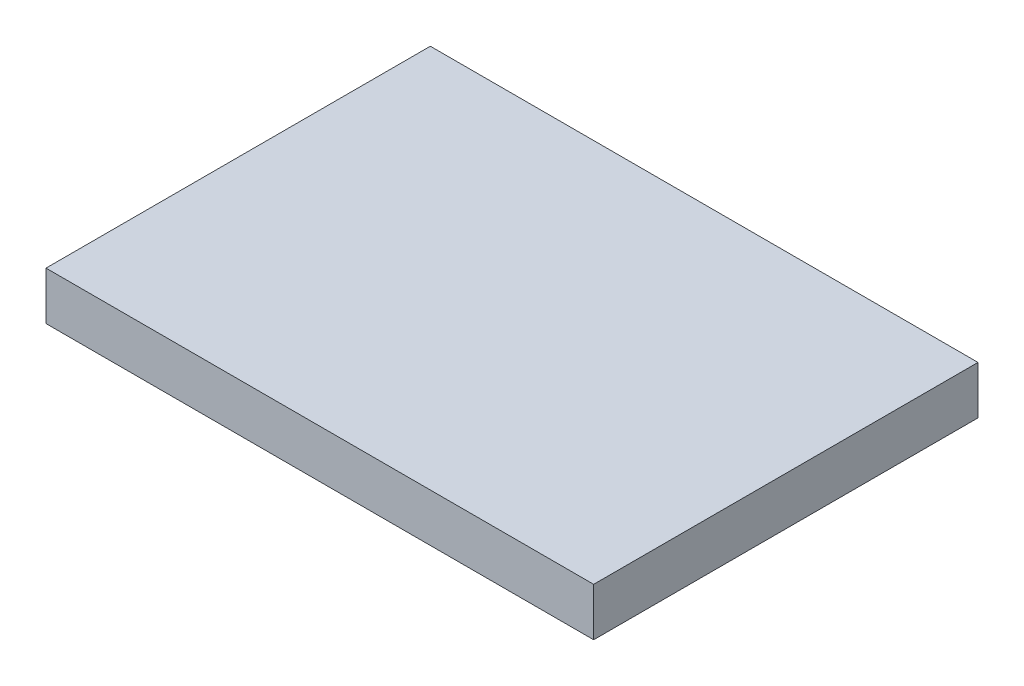
ISO-10303-21;
HEADER;
FILE_DESCRIPTION(('STEP AP214'),'2;1');
FILE_NAME('part.step','',(''),(''),'','','');
FILE_SCHEMA(('AUTOMOTIVE_DESIGN { 1 0 10303 214 1 1 1 1 }'));
ENDSEC;
DATA;
#1=APPLICATION_CONTEXT('core data for automotive mechanical design processes');
#2=APPLICATION_PROTOCOL_DEFINITION('international standard','automotive_design',2000,#1);
#3=PRODUCT_CONTEXT('',#1,'mechanical');
#4=PRODUCT('Part','Part','',(#3));
#5=PRODUCT_RELATED_PRODUCT_CATEGORY('part','',(#4));
#6=PRODUCT_DEFINITION_FORMATION('','',#4);
#7=PRODUCT_DEFINITION_CONTEXT('part definition',#1,'design');
#8=PRODUCT_DEFINITION('design','',#6,#7);
#9=PRODUCT_DEFINITION_SHAPE('','',#8);
#10=(LENGTH_UNIT() NAMED_UNIT(*) SI_UNIT(.MILLI.,.METRE.));
#11=(NAMED_UNIT(*) PLANE_ANGLE_UNIT() SI_UNIT($,.RADIAN.));
#12=(NAMED_UNIT(*) SI_UNIT($,.STERADIAN.) SOLID_ANGLE_UNIT());
#13=UNCERTAINTY_MEASURE_WITH_UNIT(LENGTH_MEASURE(1.E-05),#10,'distance_accuracy_value','');
#14=(GEOMETRIC_REPRESENTATION_CONTEXT(3) GLOBAL_UNCERTAINTY_ASSIGNED_CONTEXT((#13)) GLOBAL_UNIT_ASSIGNED_CONTEXT((#10,
#11,#12)) REPRESENTATION_CONTEXT('',''));
#15=CARTESIAN_POINT('',(0.,0.,0.));
#16=DIRECTION('',(0.,0.,1.));
#17=DIRECTION('',(1.,0.,0.));
#18=AXIS2_PLACEMENT_3D('',#15,#16,#17);
#19=CARTESIAN_POINT('',(-40.8625954198473,5.,-12.4885496183206));
#20=DIRECTION('',(1.,0.,0.));
#21=DIRECTION('',(0.,0.,-1.));
#22=AXIS2_PLACEMENT_3D('',#19,#20,#21);
#23=PLANE('',#22);
#24=DIRECTION('',(0.,0.,1.));
#25=VECTOR('',#24,1.);
#26=CARTESIAN_POINT('',(-40.8625954198473,0.,-12.4885496183206));
#27=LINE('',#26,#25);
#28=CARTESIAN_POINT('',(-40.8625954198473,0.,-12.4885496183206));
#29=VERTEX_POINT('',#28);
#30=CARTESIAN_POINT('',(-40.8625954198473,0.,27.5114503816794));
#31=VERTEX_POINT('',#30);
#32=EDGE_CURVE('E96',#29,#31,#27,.T.);
#33=ORIENTED_EDGE('',*,*,#32,.T.);
#34=DIRECTION('',(0.,-1.,0.));
#35=VECTOR('',#34,1.);
#36=CARTESIAN_POINT('',(-40.8625954198473,5.,27.5114503816794));
#37=LINE('',#36,#35);
#38=CARTESIAN_POINT('',(-40.8625954198473,5.,27.5114503816794));
#39=VERTEX_POINT('',#38);
#40=EDGE_CURVE('E11',#39,#31,#37,.T.);
#41=ORIENTED_EDGE('',*,*,#40,.F.);
#42=DIRECTION('',(0.,0.,1.));
#43=VECTOR('',#42,1.);
#44=CARTESIAN_POINT('',(-40.8625954198473,5.,-12.4885496183206));
#45=LINE('',#44,#43);
#46=CARTESIAN_POINT('',(-40.8625954198473,5.,-12.4885496183206));
#47=VERTEX_POINT('',#46);
#48=EDGE_CURVE('E84',#47,#39,#45,.T.);
#49=ORIENTED_EDGE('',*,*,#48,.F.);
#50=DIRECTION('',(0.,-1.,0.));
#51=VECTOR('',#50,1.);
#52=CARTESIAN_POINT('',(-40.8625954198473,5.,-12.4885496183206));
#53=LINE('',#52,#51);
#54=EDGE_CURVE('E92',#47,#29,#53,.T.);
#55=ORIENTED_EDGE('',*,*,#54,.T.);
#56=EDGE_LOOP('',(#33,#41,#49,#55));
#57=FACE_BOUND('',#56,.T.);
#58=ADVANCED_FACE('F33',(#57),#23,.F.);
#59=CARTESIAN_POINT('',(-40.8625954198473,5.,27.5114503816794));
#60=DIRECTION('',(0.,0.,-1.));
#61=DIRECTION('',(-1.,0.,0.));
#62=AXIS2_PLACEMENT_3D('',#59,#60,#61);
#63=PLANE('',#62);
#64=DIRECTION('',(1.,0.,0.));
#65=VECTOR('',#64,1.);
#66=CARTESIAN_POINT('',(-40.8625954198473,0.,27.5114503816794));
#67=LINE('',#66,#65);
#68=CARTESIAN_POINT('',(16.1374045801527,0.,27.5114503816794));
#69=VERTEX_POINT('',#68);
#70=EDGE_CURVE('E88',#31,#69,#67,.T.);
#71=ORIENTED_EDGE('',*,*,#70,.T.);
#72=DIRECTION('',(0.,-1.,0.));
#73=VECTOR('',#72,1.);
#74=CARTESIAN_POINT('',(16.1374045801527,5.,27.5114503816794));
#75=LINE('',#74,#73);
#76=CARTESIAN_POINT('',(16.1374045801527,5.,27.5114503816794));
#77=VERTEX_POINT('',#76);
#78=EDGE_CURVE('E41',#77,#69,#75,.T.);
#79=ORIENTED_EDGE('',*,*,#78,.F.);
#80=DIRECTION('',(1.,0.,0.));
#81=VECTOR('',#80,1.);
#82=CARTESIAN_POINT('',(-40.8625954198473,5.,27.5114503816794));
#83=LINE('',#82,#81);
#84=EDGE_CURVE('E79',#39,#77,#83,.T.);
#85=ORIENTED_EDGE('',*,*,#84,.F.);
#86=ORIENTED_EDGE('',*,*,#40,.T.);
#87=EDGE_LOOP('',(#71,#79,#85,#86));
#88=FACE_BOUND('',#87,.T.);
#89=ADVANCED_FACE('F87',(#88),#63,.F.);
#90=CARTESIAN_POINT('',(16.1374045801527,5.,-12.4885496183206));
#91=DIRECTION('',(-1.,0.,0.));
#92=DIRECTION('',(0.,0.,1.));
#93=AXIS2_PLACEMENT_3D('',#90,#91,#92);
#94=PLANE('',#93);
#95=DIRECTION('',(0.,0.,-1.));
#96=VECTOR('',#95,1.);
#97=CARTESIAN_POINT('',(16.1374045801527,0.,-12.4885496183206));
#98=LINE('',#97,#96);
#99=CARTESIAN_POINT('',(16.1374045801527,0.,-12.4885496183206));
#100=VERTEX_POINT('',#99);
#101=EDGE_CURVE('E66',#69,#100,#98,.T.);
#102=ORIENTED_EDGE('',*,*,#101,.T.);
#103=DIRECTION('',(0.,-1.,0.));
#104=VECTOR('',#103,1.);
#105=CARTESIAN_POINT('',(16.1374045801527,5.,-12.4885496183206));
#106=LINE('',#105,#104);
#107=CARTESIAN_POINT('',(16.1374045801527,5.,-12.4885496183206));
#108=VERTEX_POINT('',#107);
#109=EDGE_CURVE('E89',#108,#100,#106,.T.);
#110=ORIENTED_EDGE('',*,*,#109,.F.);
#111=DIRECTION('',(0.,0.,-1.));
#112=VECTOR('',#111,1.);
#113=CARTESIAN_POINT('',(16.1374045801527,5.,-12.4885496183206));
#114=LINE('',#113,#112);
#115=EDGE_CURVE('E82',#77,#108,#114,.T.);
#116=ORIENTED_EDGE('',*,*,#115,.F.);
#117=ORIENTED_EDGE('',*,*,#78,.T.);
#118=EDGE_LOOP('',(#102,#110,#116,#117));
#119=FACE_BOUND('',#118,.T.);
#120=ADVANCED_FACE('F90',(#119),#94,.F.);
#121=CARTESIAN_POINT('',(-40.8625954198473,5.,-12.4885496183206));
#122=DIRECTION('',(0.,0.,1.));
#123=DIRECTION('',(1.,0.,0.));
#124=AXIS2_PLACEMENT_3D('',#121,#122,#123);
#125=PLANE('',#124);
#126=DIRECTION('',(-1.,0.,0.));
#127=VECTOR('',#126,1.);
#128=CARTESIAN_POINT('',(-40.8625954198473,0.,-12.4885496183206));
#129=LINE('',#128,#127);
#130=EDGE_CURVE('E72',#100,#29,#129,.T.);
#131=ORIENTED_EDGE('',*,*,#130,.T.);
#132=ORIENTED_EDGE('',*,*,#54,.F.);
#133=DIRECTION('',(-1.,0.,0.));
#134=VECTOR('',#133,1.);
#135=CARTESIAN_POINT('',(-40.8625954198473,5.,-12.4885496183206));
#136=LINE('',#135,#134);
#137=EDGE_CURVE('E49',#108,#47,#136,.T.);
#138=ORIENTED_EDGE('',*,*,#137,.F.);
#139=ORIENTED_EDGE('',*,*,#109,.T.);
#140=EDGE_LOOP('',(#131,#132,#138,#139));
#141=FACE_BOUND('',#140,.T.);
#142=ADVANCED_FACE('F103',(#141),#125,.F.);
#143=CARTESIAN_POINT('',(0.,5.,0.));
#144=DIRECTION('',(0.,1.,0.));
#145=DIRECTION('',(0.,0.,1.));
#146=AXIS2_PLACEMENT_3D('',#143,#144,#145);
#147=PLANE('',#146);
#148=ORIENTED_EDGE('',*,*,#48,.T.);
#149=ORIENTED_EDGE('',*,*,#84,.T.);
#150=ORIENTED_EDGE('',*,*,#115,.T.);
#151=ORIENTED_EDGE('',*,*,#137,.T.);
#152=EDGE_LOOP('',(#148,#149,#150,#151));
#153=FACE_BOUND('',#152,.T.);
#154=ADVANCED_FACE('F80',(#153),#147,.T.);
#155=CARTESIAN_POINT('',(0.,0.,0.));
#156=DIRECTION('',(0.,1.,0.));
#157=DIRECTION('',(0.,0.,1.));
#158=AXIS2_PLACEMENT_3D('',#155,#156,#157);
#159=PLANE('',#158);
#160=ORIENTED_EDGE('',*,*,#32,.F.);
#161=ORIENTED_EDGE('',*,*,#130,.F.);
#162=ORIENTED_EDGE('',*,*,#101,.F.);
#163=ORIENTED_EDGE('',*,*,#70,.F.);
#164=EDGE_LOOP('',(#160,#161,#162,#163));
#165=FACE_BOUND('',#164,.T.);
#166=ADVANCED_FACE('F106',(#165),#159,.F.);
#167=CLOSED_SHELL('',(#58,#89,#120,#142,#154,#166));
#168=MANIFOLD_SOLID_BREP('B2',#167);
#169=ADVANCED_BREP_SHAPE_REPRESENTATION('',(#18,#168),#14);
#170=SHAPE_DEFINITION_REPRESENTATION(#9,#169);
ENDSEC;
END-ISO-10303-21;
